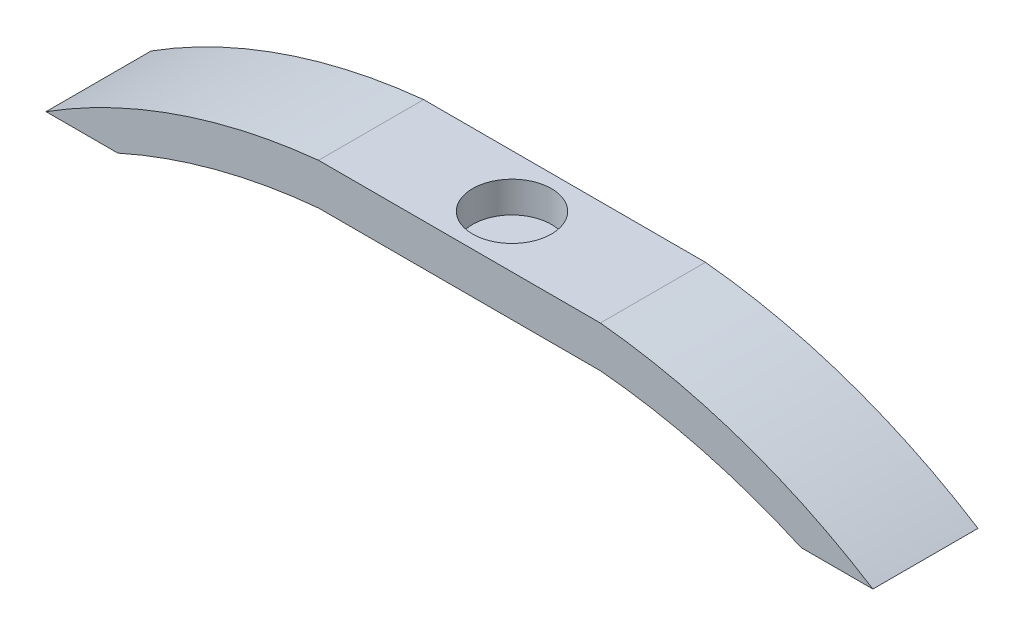
ISO-10303-21;
HEADER;
FILE_DESCRIPTION(('STEP AP214'),'2;1');
FILE_NAME('part.step','',(''),(''),'','','');
FILE_SCHEMA(('AUTOMOTIVE_DESIGN { 1 0 10303 214 1 1 1 1 }'));
ENDSEC;
DATA;
#1=APPLICATION_CONTEXT('core data for automotive mechanical design processes');
#2=APPLICATION_PROTOCOL_DEFINITION('international standard','automotive_design',2000,#1);
#3=PRODUCT_CONTEXT('',#1,'mechanical');
#4=PRODUCT('Part','Part','',(#3));
#5=PRODUCT_RELATED_PRODUCT_CATEGORY('part','',(#4));
#6=PRODUCT_DEFINITION_FORMATION('','',#4);
#7=PRODUCT_DEFINITION_CONTEXT('part definition',#1,'design');
#8=PRODUCT_DEFINITION('design','',#6,#7);
#9=PRODUCT_DEFINITION_SHAPE('','',#8);
#10=(LENGTH_UNIT() NAMED_UNIT(*) SI_UNIT(.MILLI.,.METRE.));
#11=(NAMED_UNIT(*) PLANE_ANGLE_UNIT() SI_UNIT($,.RADIAN.));
#12=(NAMED_UNIT(*) SI_UNIT($,.STERADIAN.) SOLID_ANGLE_UNIT());
#13=UNCERTAINTY_MEASURE_WITH_UNIT(LENGTH_MEASURE(1.E-05),#10,'distance_accuracy_value','');
#14=(GEOMETRIC_REPRESENTATION_CONTEXT(3) GLOBAL_UNCERTAINTY_ASSIGNED_CONTEXT((#13)) GLOBAL_UNIT_ASSIGNED_CONTEXT((#10,
#11,#12)) REPRESENTATION_CONTEXT('',''));
#15=CARTESIAN_POINT('',(0.,0.,0.));
#16=DIRECTION('',(0.,0.,1.));
#17=DIRECTION('',(1.,0.,0.));
#18=AXIS2_PLACEMENT_3D('',#15,#16,#17);
#19=CARTESIAN_POINT('',(-7.61999999999999,4.,-5.08));
#20=DIRECTION('',(0.,0.,1.));
#21=DIRECTION('',(1.,0.,0.));
#22=AXIS2_PLACEMENT_3D('',#19,#20,#21);
#23=PLANE('',#22);
#24=DIRECTION('',(-1.,0.,0.));
#25=VECTOR('',#24,1.);
#26=CARTESIAN_POINT('',(-7.61999999999999,0.,-5.08));
#27=LINE('',#26,#25);
#28=CARTESIAN_POINT('',(13.62,0.,-5.08));
#29=VERTEX_POINT('',#28);
#30=CARTESIAN_POINT('',(-13.62,0.,-5.08));
#31=VERTEX_POINT('',#30);
#32=EDGE_CURVE('E146',#29,#31,#27,.T.);
#33=ORIENTED_EDGE('',*,*,#32,.T.);
#34=CARTESIAN_POINT('',(-8.13905838558688,-60.3215067701346,-5.08));
#35=DIRECTION('',(0.,0.,1.));
#36=DIRECTION('',(1.,0.,0.));
#37=AXIS2_PLACEMENT_3D('',#34,#35,#36);
#38=CIRCLE('',#37,60.57);
#39=CARTESIAN_POINT('',(-33.025,-5.1,-5.08000000000002));
#40=VERTEX_POINT('',#39);
#41=EDGE_CURVE('E134',#31,#40,#38,.T.);
#42=ORIENTED_EDGE('',*,*,#41,.T.);
#43=DIRECTION('',(-1.,0.,0.));
#44=VECTOR('',#43,1.);
#45=CARTESIAN_POINT('',(0.,-5.09999999999997,-5.08));
#46=LINE('',#45,#44);
#47=CARTESIAN_POINT('',(-39.965,-5.10000000000001,-5.08));
#48=VERTEX_POINT('',#47);
#49=EDGE_CURVE('E139',#40,#48,#46,.T.);
#50=ORIENTED_EDGE('',*,*,#49,.T.);
#51=CARTESIAN_POINT('',(-7.54766795887322,-56.2648461674159,-5.08));
#52=DIRECTION('',(0.,0.,1.));
#53=DIRECTION('',(1.,0.,0.));
#54=AXIS2_PLACEMENT_3D('',#51,#52,#53);
#55=CIRCLE('',#54,60.57);
#56=CARTESIAN_POINT('',(-13.62,4.,-5.08));
#57=VERTEX_POINT('',#56);
#58=EDGE_CURVE('E109',#57,#48,#55,.T.);
#59=ORIENTED_EDGE('',*,*,#58,.F.);
#60=DIRECTION('',(-1.,0.,0.));
#61=VECTOR('',#60,1.);
#62=CARTESIAN_POINT('',(-7.61999999999999,4.,-5.08));
#63=LINE('',#62,#61);
#64=CARTESIAN_POINT('',(13.62,4.,-5.08));
#65=VERTEX_POINT('',#64);
#66=EDGE_CURVE('E47',#65,#57,#63,.T.);
#67=ORIENTED_EDGE('',*,*,#66,.F.);
#68=CARTESIAN_POINT('',(7.54766795887324,-56.2648461674159,-5.08));
#69=DIRECTION('',(0.,0.,1.));
#70=DIRECTION('',(1.,0.,0.));
#71=AXIS2_PLACEMENT_3D('',#68,#69,#70);
#72=CIRCLE('',#71,60.57);
#73=CARTESIAN_POINT('',(39.965,-5.1,-5.08000000000002));
#74=VERTEX_POINT('',#73);
#75=EDGE_CURVE('E142',#65,#74,#72,.F.);
#76=ORIENTED_EDGE('',*,*,#75,.T.);
#77=DIRECTION('',(1.,0.,0.));
#78=VECTOR('',#77,1.);
#79=CARTESIAN_POINT('',(0.,-5.09999999999998,-5.08));
#80=LINE('',#79,#78);
#81=CARTESIAN_POINT('',(33.025,-5.1,-5.08));
#82=VERTEX_POINT('',#81);
#83=EDGE_CURVE('E60',#82,#74,#80,.T.);
#84=ORIENTED_EDGE('',*,*,#83,.F.);
#85=CARTESIAN_POINT('',(8.13905838558689,-60.3215067701346,-5.08));
#86=DIRECTION('',(0.,0.,1.));
#87=DIRECTION('',(1.,0.,0.));
#88=AXIS2_PLACEMENT_3D('',#85,#86,#87);
#89=CIRCLE('',#88,60.57);
#90=EDGE_CURVE('E144',#29,#82,#89,.F.);
#91=ORIENTED_EDGE('',*,*,#90,.F.);
#92=EDGE_LOOP('',(#33,#42,#50,#59,#67,#76,#84,#91));
#93=FACE_BOUND('',#92,.T.);
#94=ADVANCED_FACE('F39',(#93),#23,.F.);
#95=CARTESIAN_POINT('',(-7.61999999999999,4.,5.08));
#96=DIRECTION('',(0.,0.,-1.));
#97=DIRECTION('',(-1.,0.,0.));
#98=AXIS2_PLACEMENT_3D('',#95,#96,#97);
#99=PLANE('',#98);
#100=DIRECTION('',(1.,0.,0.));
#101=VECTOR('',#100,1.);
#102=CARTESIAN_POINT('',(-7.61999999999999,0.,5.08));
#103=LINE('',#102,#101);
#104=CARTESIAN_POINT('',(-13.62,0.,5.08));
#105=VERTEX_POINT('',#104);
#106=CARTESIAN_POINT('',(13.62,0.,5.08));
#107=VERTEX_POINT('',#106);
#108=EDGE_CURVE('E42',#105,#107,#103,.T.);
#109=ORIENTED_EDGE('',*,*,#108,.T.);
#110=CARTESIAN_POINT('',(8.13905838558689,-60.3215067701346,5.08));
#111=DIRECTION('',(0.,0.,1.));
#112=DIRECTION('',(1.,0.,0.));
#113=AXIS2_PLACEMENT_3D('',#110,#111,#112);
#114=CIRCLE('',#113,60.57);
#115=CARTESIAN_POINT('',(33.025,-5.1,5.08));
#116=VERTEX_POINT('',#115);
#117=EDGE_CURVE('E141',#116,#107,#114,.T.);
#118=ORIENTED_EDGE('',*,*,#117,.F.);
#119=DIRECTION('',(-1.,0.,0.));
#120=VECTOR('',#119,1.);
#121=CARTESIAN_POINT('',(0.,-5.09999999999998,5.08));
#122=LINE('',#121,#120);
#123=CARTESIAN_POINT('',(39.965,-5.1,5.08));
#124=VERTEX_POINT('',#123);
#125=EDGE_CURVE('E149',#124,#116,#122,.T.);
#126=ORIENTED_EDGE('',*,*,#125,.F.);
#127=CARTESIAN_POINT('',(7.54766795887324,-56.2648461674159,5.08));
#128=DIRECTION('',(0.,0.,1.));
#129=DIRECTION('',(1.,0.,0.));
#130=AXIS2_PLACEMENT_3D('',#127,#128,#129);
#131=CIRCLE('',#130,60.57);
#132=CARTESIAN_POINT('',(13.62,4.,5.08));
#133=VERTEX_POINT('',#132);
#134=EDGE_CURVE('E152',#124,#133,#131,.T.);
#135=ORIENTED_EDGE('',*,*,#134,.T.);
#136=DIRECTION('',(1.,0.,0.));
#137=VECTOR('',#136,1.);
#138=CARTESIAN_POINT('',(-7.61999999999999,4.,5.08));
#139=LINE('',#138,#137);
#140=CARTESIAN_POINT('',(-13.62,4.,5.08));
#141=VERTEX_POINT('',#140);
#142=EDGE_CURVE('E11',#141,#133,#139,.T.);
#143=ORIENTED_EDGE('',*,*,#142,.F.);
#144=CARTESIAN_POINT('',(-7.54766795887322,-56.2648461674159,5.08));
#145=DIRECTION('',(0.,0.,1.));
#146=DIRECTION('',(1.,0.,0.));
#147=AXIS2_PLACEMENT_3D('',#144,#145,#146);
#148=CIRCLE('',#147,60.57);
#149=CARTESIAN_POINT('',(-39.965,-5.10000000000001,5.08));
#150=VERTEX_POINT('',#149);
#151=EDGE_CURVE('E108',#150,#141,#148,.F.);
#152=ORIENTED_EDGE('',*,*,#151,.F.);
#153=DIRECTION('',(1.,0.,0.));
#154=VECTOR('',#153,1.);
#155=CARTESIAN_POINT('',(0.,-5.09999999999997,5.08));
#156=LINE('',#155,#154);
#157=CARTESIAN_POINT('',(-33.025,-5.1,5.08));
#158=VERTEX_POINT('',#157);
#159=EDGE_CURVE('E120',#150,#158,#156,.T.);
#160=ORIENTED_EDGE('',*,*,#159,.T.);
#161=CARTESIAN_POINT('',(-8.13905838558688,-60.3215067701346,5.08));
#162=DIRECTION('',(0.,0.,1.));
#163=DIRECTION('',(1.,0.,0.));
#164=AXIS2_PLACEMENT_3D('',#161,#162,#163);
#165=CIRCLE('',#164,60.57);
#166=EDGE_CURVE('E114',#158,#105,#165,.F.);
#167=ORIENTED_EDGE('',*,*,#166,.T.);
#168=EDGE_LOOP('',(#109,#118,#126,#135,#143,#152,#160,#167));
#169=FACE_BOUND('',#168,.T.);
#170=ADVANCED_FACE('F118',(#169),#99,.F.);
#171=CARTESIAN_POINT('',(0.,4.,0.));
#172=DIRECTION('',(0.,1.,0.));
#173=DIRECTION('',(0.,0.,1.));
#174=AXIS2_PLACEMENT_3D('',#171,#172,#173);
#175=PLANE('',#174);
#176=CARTESIAN_POINT('',(0.,4.,0.));
#177=DIRECTION('',(0.,1.,0.));
#178=DIRECTION('',(0.,0.,1.));
#179=AXIS2_PLACEMENT_3D('',#176,#177,#178);
#180=CIRCLE('',#179,3.81);
#181=CARTESIAN_POINT('',(0.,4.,3.81));
#182=VERTEX_POINT('',#181);
#183=EDGE_CURVE('E186',#182,#182,#180,.T.);
#184=ORIENTED_EDGE('',*,*,#183,.F.);
#185=EDGE_LOOP('',(#184));
#186=FACE_BOUND('',#185,.T.);
#187=ORIENTED_EDGE('',*,*,#142,.T.);
#188=DIRECTION('',(0.,0.,1.));
#189=VECTOR('',#188,1.);
#190=CARTESIAN_POINT('',(13.62,4.,-38.6807295307706));
#191=LINE('',#190,#189);
#192=EDGE_CURVE('E158',#65,#133,#191,.T.);
#193=ORIENTED_EDGE('',*,*,#192,.F.);
#194=ORIENTED_EDGE('',*,*,#66,.T.);
#195=DIRECTION('',(0.,0.,1.));
#196=VECTOR('',#195,1.);
#197=CARTESIAN_POINT('',(-13.62,4.,-38.6807295307706));
#198=LINE('',#197,#196);
#199=EDGE_CURVE('E132',#57,#141,#198,.T.);
#200=ORIENTED_EDGE('',*,*,#199,.T.);
#201=EDGE_LOOP('',(#187,#193,#194,#200));
#202=FACE_BOUND('',#201,.T.);
#203=ADVANCED_FACE('F183',(#186,#202),#175,.T.);
#204=CARTESIAN_POINT('',(0.,0.,0.));
#205=DIRECTION('',(0.,1.,0.));
#206=DIRECTION('',(0.,0.,1.));
#207=AXIS2_PLACEMENT_3D('',#204,#205,#206);
#208=PLANE('',#207);
#209=ORIENTED_EDGE('',*,*,#32,.F.);
#210=DIRECTION('',(0.,0.,1.));
#211=VECTOR('',#210,1.);
#212=CARTESIAN_POINT('',(13.62,0.,-38.6807295307706));
#213=LINE('',#212,#211);
#214=EDGE_CURVE('E155',#29,#107,#213,.T.);
#215=ORIENTED_EDGE('',*,*,#214,.T.);
#216=ORIENTED_EDGE('',*,*,#108,.F.);
#217=DIRECTION('',(0.,0.,1.));
#218=VECTOR('',#217,1.);
#219=CARTESIAN_POINT('',(-13.62,0.,-38.6807295307706));
#220=LINE('',#219,#218);
#221=EDGE_CURVE('E135',#31,#105,#220,.T.);
#222=ORIENTED_EDGE('',*,*,#221,.F.);
#223=EDGE_LOOP('',(#209,#215,#216,#222));
#224=FACE_BOUND('',#223,.T.);
#225=ADVANCED_FACE('F171',(#224),#208,.F.);
#226=CARTESIAN_POINT('',(0.,-5.09999999999998,-38.6807295307706));
#227=DIRECTION('',(0.,1.,0.));
#228=DIRECTION('',(-1.,0.,0.));
#229=AXIS2_PLACEMENT_3D('',#226,#227,#228);
#230=PLANE('',#229);
#231=DIRECTION('',(0.,0.,1.));
#232=VECTOR('',#231,1.);
#233=CARTESIAN_POINT('',(33.025,-5.1,-38.6807295307706));
#234=LINE('',#233,#232);
#235=EDGE_CURVE('E154',#82,#116,#234,.T.);
#236=ORIENTED_EDGE('',*,*,#235,.F.);
#237=ORIENTED_EDGE('',*,*,#83,.T.);
#238=DIRECTION('',(0.,0.,1.));
#239=VECTOR('',#238,1.);
#240=CARTESIAN_POINT('',(39.965,-5.1,-38.6807295307706));
#241=LINE('',#240,#239);
#242=EDGE_CURVE('E161',#74,#124,#241,.T.);
#243=ORIENTED_EDGE('',*,*,#242,.T.);
#244=ORIENTED_EDGE('',*,*,#125,.T.);
#245=EDGE_LOOP('',(#236,#237,#243,#244));
#246=FACE_BOUND('',#245,.T.);
#247=ADVANCED_FACE('F176',(#246),#230,.F.);
#248=CARTESIAN_POINT('',(7.54766795887324,-56.2648461674159,-38.6807295307706));
#249=DIRECTION('',(0.,0.,1.));
#250=DIRECTION('',(1.,0.,0.));
#251=AXIS2_PLACEMENT_3D('',#248,#249,#250);
#252=CYLINDRICAL_SURFACE('',#251,60.57);
#253=ORIENTED_EDGE('',*,*,#75,.F.);
#254=ORIENTED_EDGE('',*,*,#192,.T.);
#255=ORIENTED_EDGE('',*,*,#134,.F.);
#256=ORIENTED_EDGE('',*,*,#242,.F.);
#257=EDGE_LOOP('',(#253,#254,#255,#256));
#258=FACE_BOUND('',#257,.T.);
#259=ADVANCED_FACE('F181',(#258),#252,.T.);
#260=CARTESIAN_POINT('',(8.13905838558689,-60.3215067701346,-38.6807295307706));
#261=DIRECTION('',(0.,0.,1.));
#262=DIRECTION('',(1.,0.,0.));
#263=AXIS2_PLACEMENT_3D('',#260,#261,#262);
#264=CYLINDRICAL_SURFACE('',#263,60.57);
#265=ORIENTED_EDGE('',*,*,#214,.F.);
#266=ORIENTED_EDGE('',*,*,#90,.T.);
#267=ORIENTED_EDGE('',*,*,#235,.T.);
#268=ORIENTED_EDGE('',*,*,#117,.T.);
#269=EDGE_LOOP('',(#265,#266,#267,#268));
#270=FACE_BOUND('',#269,.T.);
#271=ADVANCED_FACE('F173',(#270),#264,.F.);
#272=CARTESIAN_POINT('',(-7.54766795887322,-56.2648461674159,-38.6807295307706));
#273=DIRECTION('',(0.,0.,1.));
#274=DIRECTION('',(1.,0.,0.));
#275=AXIS2_PLACEMENT_3D('',#272,#273,#274);
#276=CYLINDRICAL_SURFACE('',#275,60.57);
#277=ORIENTED_EDGE('',*,*,#199,.F.);
#278=ORIENTED_EDGE('',*,*,#58,.T.);
#279=DIRECTION('',(0.,0.,1.));
#280=VECTOR('',#279,1.);
#281=CARTESIAN_POINT('',(-39.965,-5.10000000000001,-38.6807295307706));
#282=LINE('',#281,#280);
#283=EDGE_CURVE('E104',#48,#150,#282,.T.);
#284=ORIENTED_EDGE('',*,*,#283,.T.);
#285=ORIENTED_EDGE('',*,*,#151,.T.);
#286=EDGE_LOOP('',(#277,#278,#284,#285));
#287=FACE_BOUND('',#286,.T.);
#288=ADVANCED_FACE('F107',(#287),#276,.T.);
#289=CARTESIAN_POINT('',(-8.13905838558688,-60.3215067701346,-38.6807295307706));
#290=DIRECTION('',(0.,0.,1.));
#291=DIRECTION('',(1.,0.,0.));
#292=AXIS2_PLACEMENT_3D('',#289,#290,#291);
#293=CYLINDRICAL_SURFACE('',#292,60.57);
#294=ORIENTED_EDGE('',*,*,#41,.F.);
#295=ORIENTED_EDGE('',*,*,#221,.T.);
#296=ORIENTED_EDGE('',*,*,#166,.F.);
#297=DIRECTION('',(0.,0.,1.));
#298=VECTOR('',#297,1.);
#299=CARTESIAN_POINT('',(-33.025,-5.1,-38.6807295307706));
#300=LINE('',#299,#298);
#301=EDGE_CURVE('E113',#40,#158,#300,.T.);
#302=ORIENTED_EDGE('',*,*,#301,.F.);
#303=EDGE_LOOP('',(#294,#295,#296,#302));
#304=FACE_BOUND('',#303,.T.);
#305=ADVANCED_FACE('F259',(#304),#293,.F.);
#306=CARTESIAN_POINT('',(0.,-5.09999999999997,-38.6807295307706));
#307=DIRECTION('',(0.,-1.,0.));
#308=DIRECTION('',(1.,0.,0.));
#309=AXIS2_PLACEMENT_3D('',#306,#307,#308);
#310=PLANE('',#309);
#311=ORIENTED_EDGE('',*,*,#49,.F.);
#312=ORIENTED_EDGE('',*,*,#301,.T.);
#313=ORIENTED_EDGE('',*,*,#159,.F.);
#314=ORIENTED_EDGE('',*,*,#283,.F.);
#315=EDGE_LOOP('',(#311,#312,#313,#314));
#316=FACE_BOUND('',#315,.T.);
#317=ADVANCED_FACE('F125',(#316),#310,.T.);
#318=CARTESIAN_POINT('',(0.,1.,0.));
#319=DIRECTION('',(0.,1.,0.));
#320=DIRECTION('',(0.,0.,1.));
#321=AXIS2_PLACEMENT_3D('',#318,#319,#320);
#322=CYLINDRICAL_SURFACE('',#321,3.81);
#323=CARTESIAN_POINT('',(0.,1.,0.));
#324=DIRECTION('',(0.,1.,0.));
#325=DIRECTION('',(0.,0.,1.));
#326=AXIS2_PLACEMENT_3D('',#323,#324,#325);
#327=CIRCLE('',#326,3.81);
#328=CARTESIAN_POINT('',(0.,1.,3.81));
#329=VERTEX_POINT('',#328);
#330=EDGE_CURVE('E123',#329,#329,#327,.T.);
#331=ORIENTED_EDGE('',*,*,#330,.F.);
#332=EDGE_LOOP('',(#331));
#333=FACE_BOUND('',#332,.T.);
#334=ORIENTED_EDGE('',*,*,#183,.T.);
#335=EDGE_LOOP('',(#334));
#336=FACE_BOUND('',#335,.T.);
#337=ADVANCED_FACE('F194',(#333,#336),#322,.F.);
#338=CARTESIAN_POINT('',(0.,1.,0.));
#339=DIRECTION('',(0.,1.,0.));
#340=DIRECTION('',(0.,0.,1.));
#341=AXIS2_PLACEMENT_3D('',#338,#339,#340);
#342=PLANE('',#341);
#343=ORIENTED_EDGE('',*,*,#330,.T.);
#344=EDGE_LOOP('',(#343));
#345=FACE_BOUND('',#344,.T.);
#346=ADVANCED_FACE('F192',(#345),#342,.T.);
#347=CLOSED_SHELL('',(#94,#170,#203,#225,#247,#259,#271,#288,#305,#317,#337,#346));
#348=MANIFOLD_SOLID_BREP('B2',#347);
#349=ADVANCED_BREP_SHAPE_REPRESENTATION('',(#18,#348),#14);
#350=SHAPE_DEFINITION_REPRESENTATION(#9,#349);
ENDSEC;
END-ISO-10303-21;
